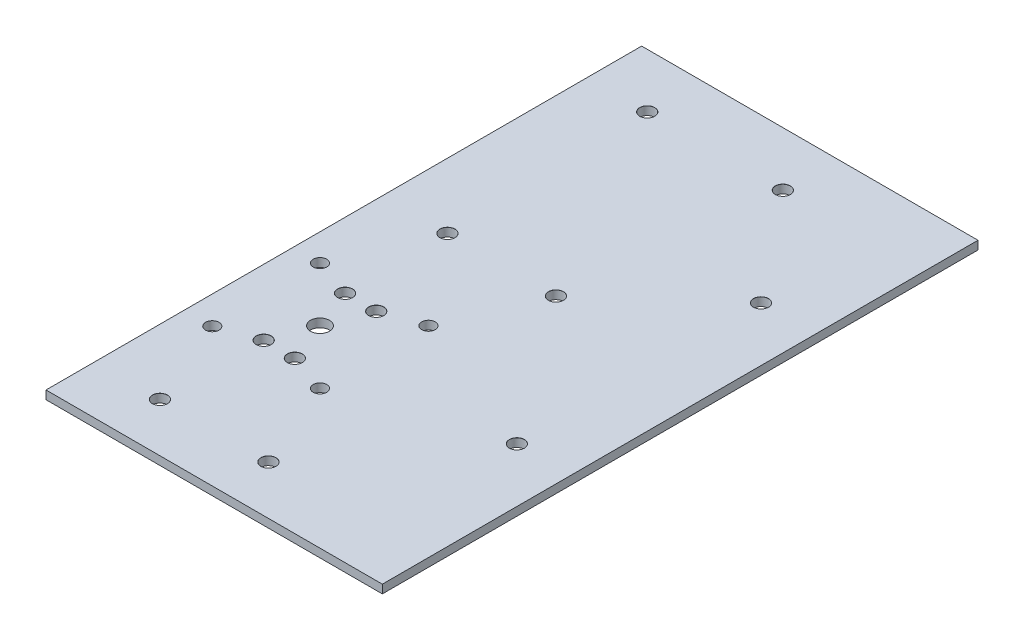
ISO-10303-21;
HEADER;
FILE_DESCRIPTION(('STEP AP214'),'2;1');
FILE_NAME('part.step','',(''),(''),'','','');
FILE_SCHEMA(('AUTOMOTIVE_DESIGN { 1 0 10303 214 1 1 1 1 }'));
ENDSEC;
DATA;
#1=APPLICATION_CONTEXT('core data for automotive mechanical design processes');
#2=APPLICATION_PROTOCOL_DEFINITION('international standard','automotive_design',2000,#1);
#3=PRODUCT_CONTEXT('',#1,'mechanical');
#4=PRODUCT('Part','Part','',(#3));
#5=PRODUCT_RELATED_PRODUCT_CATEGORY('part','',(#4));
#6=PRODUCT_DEFINITION_FORMATION('','',#4);
#7=PRODUCT_DEFINITION_CONTEXT('part definition',#1,'design');
#8=PRODUCT_DEFINITION('design','',#6,#7);
#9=PRODUCT_DEFINITION_SHAPE('','',#8);
#10=(LENGTH_UNIT() NAMED_UNIT(*) SI_UNIT(.MILLI.,.METRE.));
#11=(NAMED_UNIT(*) PLANE_ANGLE_UNIT() SI_UNIT($,.RADIAN.));
#12=(NAMED_UNIT(*) SI_UNIT($,.STERADIAN.) SOLID_ANGLE_UNIT());
#13=UNCERTAINTY_MEASURE_WITH_UNIT(LENGTH_MEASURE(1.E-05),#10,'distance_accuracy_value','');
#14=(GEOMETRIC_REPRESENTATION_CONTEXT(3) GLOBAL_UNCERTAINTY_ASSIGNED_CONTEXT((#13)) GLOBAL_UNIT_ASSIGNED_CONTEXT((#10,
#11,#12)) REPRESENTATION_CONTEXT('',''));
#15=CARTESIAN_POINT('',(0.,0.,0.));
#16=DIRECTION('',(0.,0.,1.));
#17=DIRECTION('',(1.,0.,0.));
#18=AXIS2_PLACEMENT_3D('',#15,#16,#17);
#19=CARTESIAN_POINT('',(0.,3.125,0.));
#20=DIRECTION('',(0.,-1.,0.));
#21=DIRECTION('',(0.,0.,-1.));
#22=AXIS2_PLACEMENT_3D('',#19,#20,#21);
#23=PLANE('',#22);
#24=CARTESIAN_POINT('',(24.,3.125,-124.));
#25=DIRECTION('',(0.,1.,0.));
#26=DIRECTION('',(0.,0.,1.));
#27=AXIS2_PLACEMENT_3D('',#24,#25,#26);
#28=CIRCLE('',#27,2.775);
#29=CARTESIAN_POINT('',(24.,3.125,-121.225));
#30=VERTEX_POINT('',#29);
#31=EDGE_CURVE('E560',#30,#30,#28,.T.);
#32=ORIENTED_EDGE('',*,*,#31,.F.);
#33=EDGE_LOOP('',(#32));
#34=FACE_BOUND('',#33,.T.);
#35=CARTESIAN_POINT('',(64.,3.125,-124.));
#36=DIRECTION('',(0.,1.,0.));
#37=DIRECTION('',(0.,0.,1.));
#38=AXIS2_PLACEMENT_3D('',#35,#36,#37);
#39=CIRCLE('',#38,2.775);
#40=CARTESIAN_POINT('',(64.,3.125,-121.225));
#41=VERTEX_POINT('',#40);
#42=EDGE_CURVE('E567',#41,#41,#39,.T.);
#43=ORIENTED_EDGE('',*,*,#42,.F.);
#44=EDGE_LOOP('',(#43));
#45=FACE_BOUND('',#44,.T.);
#46=CARTESIAN_POINT('',(24.,3.125,-18.));
#47=DIRECTION('',(0.,1.,0.));
#48=DIRECTION('',(0.,0.,1.));
#49=AXIS2_PLACEMENT_3D('',#46,#47,#48);
#50=CIRCLE('',#49,2.775);
#51=CARTESIAN_POINT('',(24.,3.125,-15.225));
#52=VERTEX_POINT('',#51);
#53=EDGE_CURVE('E576',#52,#52,#50,.T.);
#54=ORIENTED_EDGE('',*,*,#53,.F.);
#55=EDGE_LOOP('',(#54));
#56=FACE_BOUND('',#55,.T.);
#57=CARTESIAN_POINT('',(64.,3.125,-18.));
#58=DIRECTION('',(0.,1.,0.));
#59=DIRECTION('',(0.,0.,1.));
#60=AXIS2_PLACEMENT_3D('',#57,#58,#59);
#61=CIRCLE('',#60,2.775);
#62=CARTESIAN_POINT('',(64.,3.125,-15.225));
#63=VERTEX_POINT('',#62);
#64=EDGE_CURVE('E585',#63,#63,#61,.T.);
#65=ORIENTED_EDGE('',*,*,#64,.F.);
#66=EDGE_LOOP('',(#65));
#67=FACE_BOUND('',#66,.T.);
#68=CARTESIAN_POINT('',(22.0495894973803,3.125,-199.6));
#69=DIRECTION('',(0.,1.,0.));
#70=DIRECTION('',(0.,0.,1.));
#71=AXIS2_PLACEMENT_3D('',#68,#69,#70);
#72=CIRCLE('',#71,2.775);
#73=CARTESIAN_POINT('',(22.0495894973803,3.125,-196.825));
#74=VERTEX_POINT('',#73);
#75=EDGE_CURVE('E594',#74,#74,#72,.T.);
#76=ORIENTED_EDGE('',*,*,#75,.F.);
#77=EDGE_LOOP('',(#76));
#78=FACE_BOUND('',#77,.T.);
#79=CARTESIAN_POINT('',(72.0495894973803,3.125,-199.6));
#80=DIRECTION('',(0.,1.,0.));
#81=DIRECTION('',(0.,0.,1.));
#82=AXIS2_PLACEMENT_3D('',#79,#80,#81);
#83=CIRCLE('',#82,2.775);
#84=CARTESIAN_POINT('',(72.0495894973803,3.125,-196.825));
#85=VERTEX_POINT('',#84);
#86=EDGE_CURVE('E171',#85,#85,#83,.T.);
#87=ORIENTED_EDGE('',*,*,#86,.F.);
#88=EDGE_LOOP('',(#87));
#89=FACE_BOUND('',#88,.T.);
#90=CARTESIAN_POINT('',(104.,3.125,-159.6));
#91=DIRECTION('',(0.,1.,0.));
#92=DIRECTION('',(0.,0.,1.));
#93=AXIS2_PLACEMENT_3D('',#90,#91,#92);
#94=CIRCLE('',#93,2.775);
#95=CARTESIAN_POINT('',(104.,3.125,-156.825));
#96=VERTEX_POINT('',#95);
#97=EDGE_CURVE('E164',#96,#96,#94,.T.);
#98=ORIENTED_EDGE('',*,*,#97,.F.);
#99=EDGE_LOOP('',(#98));
#100=FACE_BOUND('',#99,.T.);
#101=CARTESIAN_POINT('',(104.,3.125,-69.6));
#102=DIRECTION('',(0.,1.,0.));
#103=DIRECTION('',(0.,0.,1.));
#104=AXIS2_PLACEMENT_3D('',#101,#102,#103);
#105=CIRCLE('',#104,2.775);
#106=CARTESIAN_POINT('',(104.,3.125,-66.825));
#107=VERTEX_POINT('',#106);
#108=EDGE_CURVE('E160',#107,#107,#105,.T.);
#109=ORIENTED_EDGE('',*,*,#108,.F.);
#110=EDGE_LOOP('',(#109));
#111=FACE_BOUND('',#110,.T.);
#112=CARTESIAN_POINT('',(24.25,3.125,-86.));
#113=DIRECTION('',(0.,1.,0.));
#114=DIRECTION('',(0.,0.,1.));
#115=AXIS2_PLACEMENT_3D('',#112,#113,#114);
#116=CIRCLE('',#115,2.775);
#117=CARTESIAN_POINT('',(24.25,3.125,-83.225));
#118=VERTEX_POINT('',#117);
#119=EDGE_CURVE('E156',#118,#118,#116,.T.);
#120=ORIENTED_EDGE('',*,*,#119,.F.);
#121=EDGE_LOOP('',(#120));
#122=FACE_BOUND('',#121,.T.);
#123=CARTESIAN_POINT('',(35.75,3.125,-86.));
#124=DIRECTION('',(0.,1.,0.));
#125=DIRECTION('',(0.,0.,1.));
#126=AXIS2_PLACEMENT_3D('',#123,#124,#125);
#127=CIRCLE('',#126,2.775);
#128=CARTESIAN_POINT('',(35.75,3.125,-83.225));
#129=VERTEX_POINT('',#128);
#130=EDGE_CURVE('E151',#129,#129,#127,.T.);
#131=ORIENTED_EDGE('',*,*,#130,.F.);
#132=EDGE_LOOP('',(#131));
#133=FACE_BOUND('',#132,.T.);
#134=CARTESIAN_POINT('',(35.75,3.125,-56.));
#135=DIRECTION('',(0.,1.,0.));
#136=DIRECTION('',(0.,0.,1.));
#137=AXIS2_PLACEMENT_3D('',#134,#135,#136);
#138=CIRCLE('',#137,2.775);
#139=CARTESIAN_POINT('',(35.75,3.125,-53.225));
#140=VERTEX_POINT('',#139);
#141=EDGE_CURVE('E146',#140,#140,#138,.T.);
#142=ORIENTED_EDGE('',*,*,#141,.F.);
#143=EDGE_LOOP('',(#142));
#144=FACE_BOUND('',#143,.T.);
#145=CARTESIAN_POINT('',(24.25,3.125,-56.));
#146=DIRECTION('',(0.,1.,0.));
#147=DIRECTION('',(0.,0.,1.));
#148=AXIS2_PLACEMENT_3D('',#145,#146,#147);
#149=CIRCLE('',#148,2.775);
#150=CARTESIAN_POINT('',(24.25,3.125,-53.225));
#151=VERTEX_POINT('',#150);
#152=EDGE_CURVE('E141',#151,#151,#149,.T.);
#153=ORIENTED_EDGE('',*,*,#152,.F.);
#154=EDGE_LOOP('',(#153));
#155=FACE_BOUND('',#154,.T.);
#156=CARTESIAN_POINT('',(9.99999999999999,3.125,-91.));
#157=DIRECTION('',(0.,1.,0.));
#158=DIRECTION('',(0.,0.,1.));
#159=AXIS2_PLACEMENT_3D('',#156,#157,#158);
#160=CIRCLE('',#159,2.5);
#161=CARTESIAN_POINT('',(9.99999999999999,3.125,-88.5));
#162=VERTEX_POINT('',#161);
#163=EDGE_CURVE('E136',#162,#162,#160,.T.);
#164=ORIENTED_EDGE('',*,*,#163,.F.);
#165=EDGE_LOOP('',(#164));
#166=FACE_BOUND('',#165,.T.);
#167=CARTESIAN_POINT('',(50.,3.125,-91.));
#168=DIRECTION('',(0.,1.,0.));
#169=DIRECTION('',(0.,0.,1.));
#170=AXIS2_PLACEMENT_3D('',#167,#168,#169);
#171=CIRCLE('',#170,2.5);
#172=CARTESIAN_POINT('',(50.,3.125,-88.5));
#173=VERTEX_POINT('',#172);
#174=EDGE_CURVE('E204',#173,#173,#171,.T.);
#175=ORIENTED_EDGE('',*,*,#174,.F.);
#176=EDGE_LOOP('',(#175));
#177=FACE_BOUND('',#176,.T.);
#178=CARTESIAN_POINT('',(50.,3.125,-51.));
#179=DIRECTION('',(0.,1.,0.));
#180=DIRECTION('',(0.,0.,1.));
#181=AXIS2_PLACEMENT_3D('',#178,#179,#180);
#182=CIRCLE('',#181,2.5);
#183=CARTESIAN_POINT('',(50.,3.125,-48.5));
#184=VERTEX_POINT('',#183);
#185=EDGE_CURVE('E201',#184,#184,#182,.T.);
#186=ORIENTED_EDGE('',*,*,#185,.F.);
#187=EDGE_LOOP('',(#186));
#188=FACE_BOUND('',#187,.T.);
#189=CARTESIAN_POINT('',(10.3126727569179,3.125,-51.));
#190=DIRECTION('',(0.,1.,0.));
#191=DIRECTION('',(0.,0.,1.));
#192=AXIS2_PLACEMENT_3D('',#189,#190,#191);
#193=CIRCLE('',#192,2.5);
#194=CARTESIAN_POINT('',(10.3126727569179,3.125,-48.5));
#195=VERTEX_POINT('',#194);
#196=EDGE_CURVE('E123',#195,#195,#193,.T.);
#197=ORIENTED_EDGE('',*,*,#196,.F.);
#198=EDGE_LOOP('',(#197));
#199=FACE_BOUND('',#198,.T.);
#200=DIRECTION('',(0.,0.,1.));
#201=VECTOR('',#200,1.);
#202=CARTESIAN_POINT('',(0.,3.125,0.));
#203=LINE('',#202,#201);
#204=CARTESIAN_POINT('',(0.,3.125,-219.6));
#205=VERTEX_POINT('',#204);
#206=CARTESIAN_POINT('',(0.,3.125,0.));
#207=VERTEX_POINT('',#206);
#208=EDGE_CURVE('E97',#205,#207,#203,.T.);
#209=ORIENTED_EDGE('',*,*,#208,.T.);
#210=DIRECTION('',(1.,0.,0.));
#211=VECTOR('',#210,1.);
#212=CARTESIAN_POINT('',(0.,3.125,0.));
#213=LINE('',#212,#211);
#214=CARTESIAN_POINT('',(124.,3.125,0.));
#215=VERTEX_POINT('',#214);
#216=EDGE_CURVE('E92',#207,#215,#213,.T.);
#217=ORIENTED_EDGE('',*,*,#216,.T.);
#218=DIRECTION('',(0.,0.,-1.));
#219=VECTOR('',#218,1.);
#220=CARTESIAN_POINT('',(124.,3.125,0.));
#221=LINE('',#220,#219);
#222=CARTESIAN_POINT('',(124.,3.125,-219.6));
#223=VERTEX_POINT('',#222);
#224=EDGE_CURVE('E95',#215,#223,#221,.T.);
#225=ORIENTED_EDGE('',*,*,#224,.T.);
#226=DIRECTION('',(-1.,0.,0.));
#227=VECTOR('',#226,1.);
#228=CARTESIAN_POINT('',(0.,3.125,-219.6));
#229=LINE('',#228,#227);
#230=EDGE_CURVE('E62',#223,#205,#229,.T.);
#231=ORIENTED_EDGE('',*,*,#230,.T.);
#232=EDGE_LOOP('',(#209,#217,#225,#231));
#233=FACE_BOUND('',#232,.T.);
#234=CARTESIAN_POINT('',(30.,3.125,-71.));
#235=DIRECTION('',(0.,1.,0.));
#236=DIRECTION('',(0.,0.,1.));
#237=AXIS2_PLACEMENT_3D('',#234,#235,#236);
#238=CIRCLE('',#237,3.5);
#239=CARTESIAN_POINT('',(30.,3.125,-67.5));
#240=VERTEX_POINT('',#239);
#241=EDGE_CURVE('E113',#240,#240,#238,.T.);
#242=ORIENTED_EDGE('',*,*,#241,.F.);
#243=EDGE_LOOP('',(#242));
#244=FACE_BOUND('',#243,.T.);
#245=ADVANCED_FACE('F43',(#34,#45,#56,#67,#78,#89,#100,#111,#122,#133,#144,#155,#166,#177,#188,
#199,#233,#244),#23,.F.);
#246=CARTESIAN_POINT('',(0.,0.,0.));
#247=DIRECTION('',(0.,-1.,0.));
#248=DIRECTION('',(0.,0.,-1.));
#249=AXIS2_PLACEMENT_3D('',#246,#247,#248);
#250=PLANE('',#249);
#251=CARTESIAN_POINT('',(24.,0.,-124.));
#252=DIRECTION('',(0.,1.,0.));
#253=DIRECTION('',(0.,0.,1.));
#254=AXIS2_PLACEMENT_3D('',#251,#252,#253);
#255=CIRCLE('',#254,2.75);
#256=CARTESIAN_POINT('',(24.,0.,-121.25));
#257=VERTEX_POINT('',#256);
#258=EDGE_CURVE('E562',#257,#257,#255,.T.);
#259=ORIENTED_EDGE('',*,*,#258,.T.);
#260=EDGE_LOOP('',(#259));
#261=FACE_BOUND('',#260,.T.);
#262=CARTESIAN_POINT('',(64.,0.,-124.));
#263=DIRECTION('',(0.,1.,0.));
#264=DIRECTION('',(0.,0.,1.));
#265=AXIS2_PLACEMENT_3D('',#262,#263,#264);
#266=CIRCLE('',#265,2.75);
#267=CARTESIAN_POINT('',(64.,0.,-121.25));
#268=VERTEX_POINT('',#267);
#269=EDGE_CURVE('E573',#268,#268,#266,.T.);
#270=ORIENTED_EDGE('',*,*,#269,.T.);
#271=EDGE_LOOP('',(#270));
#272=FACE_BOUND('',#271,.T.);
#273=CARTESIAN_POINT('',(24.,0.,-18.));
#274=DIRECTION('',(0.,1.,0.));
#275=DIRECTION('',(0.,0.,1.));
#276=AXIS2_PLACEMENT_3D('',#273,#274,#275);
#277=CIRCLE('',#276,2.75);
#278=CARTESIAN_POINT('',(24.,0.,-15.25));
#279=VERTEX_POINT('',#278);
#280=EDGE_CURVE('E582',#279,#279,#277,.T.);
#281=ORIENTED_EDGE('',*,*,#280,.T.);
#282=EDGE_LOOP('',(#281));
#283=FACE_BOUND('',#282,.T.);
#284=CARTESIAN_POINT('',(64.,0.,-18.));
#285=DIRECTION('',(0.,1.,0.));
#286=DIRECTION('',(0.,0.,1.));
#287=AXIS2_PLACEMENT_3D('',#284,#285,#286);
#288=CIRCLE('',#287,2.75);
#289=CARTESIAN_POINT('',(64.,0.,-15.25));
#290=VERTEX_POINT('',#289);
#291=EDGE_CURVE('E591',#290,#290,#288,.T.);
#292=ORIENTED_EDGE('',*,*,#291,.T.);
#293=EDGE_LOOP('',(#292));
#294=FACE_BOUND('',#293,.T.);
#295=CARTESIAN_POINT('',(22.0495894973803,0.,-199.6));
#296=DIRECTION('',(0.,-1.,0.));
#297=DIRECTION('',(0.,0.,-1.));
#298=AXIS2_PLACEMENT_3D('',#295,#296,#297);
#299=CIRCLE('',#298,2.74999999999999);
#300=CARTESIAN_POINT('',(22.0495894973803,0.,-202.35));
#301=VERTEX_POINT('',#300);
#302=EDGE_CURVE('E47',#301,#301,#299,.T.);
#303=ORIENTED_EDGE('',*,*,#302,.F.);
#304=EDGE_LOOP('',(#303));
#305=FACE_BOUND('',#304,.T.);
#306=CARTESIAN_POINT('',(72.0495894973803,0.,-199.6));
#307=DIRECTION('',(0.,-1.,0.));
#308=DIRECTION('',(0.,0.,-1.));
#309=AXIS2_PLACEMENT_3D('',#306,#307,#308);
#310=CIRCLE('',#309,2.74999999999999);
#311=CARTESIAN_POINT('',(72.0495894973803,0.,-202.35));
#312=VERTEX_POINT('',#311);
#313=EDGE_CURVE('E162',#312,#312,#310,.T.);
#314=ORIENTED_EDGE('',*,*,#313,.F.);
#315=EDGE_LOOP('',(#314));
#316=FACE_BOUND('',#315,.T.);
#317=CARTESIAN_POINT('',(104.,0.,-159.6));
#318=DIRECTION('',(0.,-1.,0.));
#319=DIRECTION('',(0.,0.,-1.));
#320=AXIS2_PLACEMENT_3D('',#317,#318,#319);
#321=CIRCLE('',#320,2.74999999999999);
#322=CARTESIAN_POINT('',(104.,0.,-162.35));
#323=VERTEX_POINT('',#322);
#324=EDGE_CURVE('E158',#323,#323,#321,.T.);
#325=ORIENTED_EDGE('',*,*,#324,.F.);
#326=EDGE_LOOP('',(#325));
#327=FACE_BOUND('',#326,.T.);
#328=CARTESIAN_POINT('',(104.,0.,-69.6));
#329=DIRECTION('',(0.,-1.,0.));
#330=DIRECTION('',(0.,0.,-1.));
#331=AXIS2_PLACEMENT_3D('',#328,#329,#330);
#332=CIRCLE('',#331,2.74999999999999);
#333=CARTESIAN_POINT('',(104.,0.,-72.35));
#334=VERTEX_POINT('',#333);
#335=EDGE_CURVE('E153',#334,#334,#332,.T.);
#336=ORIENTED_EDGE('',*,*,#335,.F.);
#337=EDGE_LOOP('',(#336));
#338=FACE_BOUND('',#337,.T.);
#339=CARTESIAN_POINT('',(24.25,0.,-86.));
#340=DIRECTION('',(0.,-1.,0.));
#341=DIRECTION('',(0.,0.,-1.));
#342=AXIS2_PLACEMENT_3D('',#339,#340,#341);
#343=CIRCLE('',#342,2.74999999999999);
#344=CARTESIAN_POINT('',(24.25,0.,-88.75));
#345=VERTEX_POINT('',#344);
#346=EDGE_CURVE('E148',#345,#345,#343,.T.);
#347=ORIENTED_EDGE('',*,*,#346,.F.);
#348=EDGE_LOOP('',(#347));
#349=FACE_BOUND('',#348,.T.);
#350=CARTESIAN_POINT('',(35.75,0.,-86.));
#351=DIRECTION('',(0.,-1.,0.));
#352=DIRECTION('',(0.,0.,-1.));
#353=AXIS2_PLACEMENT_3D('',#350,#351,#352);
#354=CIRCLE('',#353,2.74999999999999);
#355=CARTESIAN_POINT('',(35.75,0.,-88.75));
#356=VERTEX_POINT('',#355);
#357=EDGE_CURVE('E143',#356,#356,#354,.T.);
#358=ORIENTED_EDGE('',*,*,#357,.F.);
#359=EDGE_LOOP('',(#358));
#360=FACE_BOUND('',#359,.T.);
#361=CARTESIAN_POINT('',(35.75,0.,-56.));
#362=DIRECTION('',(0.,-1.,0.));
#363=DIRECTION('',(0.,0.,-1.));
#364=AXIS2_PLACEMENT_3D('',#361,#362,#363);
#365=CIRCLE('',#364,2.74999999999999);
#366=CARTESIAN_POINT('',(35.75,0.,-58.75));
#367=VERTEX_POINT('',#366);
#368=EDGE_CURVE('E138',#367,#367,#365,.T.);
#369=ORIENTED_EDGE('',*,*,#368,.F.);
#370=EDGE_LOOP('',(#369));
#371=FACE_BOUND('',#370,.T.);
#372=CARTESIAN_POINT('',(24.25,0.,-56.));
#373=DIRECTION('',(0.,-1.,0.));
#374=DIRECTION('',(0.,0.,-1.));
#375=AXIS2_PLACEMENT_3D('',#372,#373,#374);
#376=CIRCLE('',#375,2.74999999999999);
#377=CARTESIAN_POINT('',(24.25,0.,-58.75));
#378=VERTEX_POINT('',#377);
#379=EDGE_CURVE('E133',#378,#378,#376,.T.);
#380=ORIENTED_EDGE('',*,*,#379,.F.);
#381=EDGE_LOOP('',(#380));
#382=FACE_BOUND('',#381,.T.);
#383=CARTESIAN_POINT('',(9.99999999999999,0.,-91.));
#384=DIRECTION('',(0.,-1.,0.));
#385=DIRECTION('',(0.,0.,-1.));
#386=AXIS2_PLACEMENT_3D('',#383,#384,#385);
#387=CIRCLE('',#386,2.5);
#388=CARTESIAN_POINT('',(9.99999999999999,0.,-93.5));
#389=VERTEX_POINT('',#388);
#390=EDGE_CURVE('E129',#389,#389,#387,.T.);
#391=ORIENTED_EDGE('',*,*,#390,.F.);
#392=EDGE_LOOP('',(#391));
#393=FACE_BOUND('',#392,.T.);
#394=CARTESIAN_POINT('',(50.,0.,-91.));
#395=DIRECTION('',(0.,-1.,0.));
#396=DIRECTION('',(0.,0.,-1.));
#397=AXIS2_PLACEMENT_3D('',#394,#395,#396);
#398=CIRCLE('',#397,2.5);
#399=CARTESIAN_POINT('',(50.,0.,-93.5));
#400=VERTEX_POINT('',#399);
#401=EDGE_CURVE('E126',#400,#400,#398,.T.);
#402=ORIENTED_EDGE('',*,*,#401,.F.);
#403=EDGE_LOOP('',(#402));
#404=FACE_BOUND('',#403,.T.);
#405=CARTESIAN_POINT('',(50.,0.,-51.));
#406=DIRECTION('',(0.,-1.,0.));
#407=DIRECTION('',(0.,0.,-1.));
#408=AXIS2_PLACEMENT_3D('',#405,#406,#407);
#409=CIRCLE('',#408,2.5);
#410=CARTESIAN_POINT('',(50.,0.,-53.5));
#411=VERTEX_POINT('',#410);
#412=EDGE_CURVE('E122',#411,#411,#409,.T.);
#413=ORIENTED_EDGE('',*,*,#412,.F.);
#414=EDGE_LOOP('',(#413));
#415=FACE_BOUND('',#414,.T.);
#416=CARTESIAN_POINT('',(10.3126727569179,0.,-51.));
#417=DIRECTION('',(0.,-1.,0.));
#418=DIRECTION('',(0.,0.,-1.));
#419=AXIS2_PLACEMENT_3D('',#416,#417,#418);
#420=CIRCLE('',#419,2.5);
#421=CARTESIAN_POINT('',(10.3126727569179,0.,-53.5));
#422=VERTEX_POINT('',#421);
#423=EDGE_CURVE('E119',#422,#422,#420,.T.);
#424=ORIENTED_EDGE('',*,*,#423,.F.);
#425=EDGE_LOOP('',(#424));
#426=FACE_BOUND('',#425,.T.);
#427=DIRECTION('',(0.,0.,1.));
#428=VECTOR('',#427,1.);
#429=CARTESIAN_POINT('',(0.,0.,0.));
#430=LINE('',#429,#428);
#431=CARTESIAN_POINT('',(0.,0.,-219.6));
#432=VERTEX_POINT('',#431);
#433=CARTESIAN_POINT('',(0.,0.,0.));
#434=VERTEX_POINT('',#433);
#435=EDGE_CURVE('E110',#432,#434,#430,.T.);
#436=ORIENTED_EDGE('',*,*,#435,.F.);
#437=DIRECTION('',(-1.,0.,0.));
#438=VECTOR('',#437,1.);
#439=CARTESIAN_POINT('',(0.,0.,-219.6));
#440=LINE('',#439,#438);
#441=CARTESIAN_POINT('',(124.,0.,-219.6));
#442=VERTEX_POINT('',#441);
#443=EDGE_CURVE('E85',#442,#432,#440,.T.);
#444=ORIENTED_EDGE('',*,*,#443,.F.);
#445=DIRECTION('',(0.,0.,-1.));
#446=VECTOR('',#445,1.);
#447=CARTESIAN_POINT('',(124.,0.,0.));
#448=LINE('',#447,#446);
#449=CARTESIAN_POINT('',(124.,0.,0.));
#450=VERTEX_POINT('',#449);
#451=EDGE_CURVE('E79',#450,#442,#448,.T.);
#452=ORIENTED_EDGE('',*,*,#451,.F.);
#453=DIRECTION('',(1.,0.,0.));
#454=VECTOR('',#453,1.);
#455=CARTESIAN_POINT('',(0.,0.,0.));
#456=LINE('',#455,#454);
#457=EDGE_CURVE('E101',#434,#450,#456,.T.);
#458=ORIENTED_EDGE('',*,*,#457,.F.);
#459=EDGE_LOOP('',(#436,#444,#452,#458));
#460=FACE_BOUND('',#459,.T.);
#461=CARTESIAN_POINT('',(30.,0.,-71.));
#462=DIRECTION('',(0.,1.,0.));
#463=DIRECTION('',(0.,0.,1.));
#464=AXIS2_PLACEMENT_3D('',#461,#462,#463);
#465=CIRCLE('',#464,3.5);
#466=CARTESIAN_POINT('',(30.,0.,-67.5));
#467=VERTEX_POINT('',#466);
#468=EDGE_CURVE('E132',#467,#467,#465,.T.);
#469=ORIENTED_EDGE('',*,*,#468,.T.);
#470=EDGE_LOOP('',(#469));
#471=FACE_BOUND('',#470,.T.);
#472=ADVANCED_FACE('F216',(#261,#272,#283,#294,#305,#316,#327,#338,#349,#360,#371,#382,#393,
#404,#415,#426,#460,#471),#250,.T.);
#473=CARTESIAN_POINT('',(0.,3.125,0.));
#474=DIRECTION('',(1.,0.,0.));
#475=DIRECTION('',(0.,0.,-1.));
#476=AXIS2_PLACEMENT_3D('',#473,#474,#475);
#477=PLANE('',#476);
#478=ORIENTED_EDGE('',*,*,#435,.T.);
#479=DIRECTION('',(0.,-1.,0.));
#480=VECTOR('',#479,1.);
#481=CARTESIAN_POINT('',(0.,3.125,0.));
#482=LINE('',#481,#480);
#483=EDGE_CURVE('E11',#207,#434,#482,.T.);
#484=ORIENTED_EDGE('',*,*,#483,.F.);
#485=ORIENTED_EDGE('',*,*,#208,.F.);
#486=DIRECTION('',(0.,-1.,0.));
#487=VECTOR('',#486,1.);
#488=CARTESIAN_POINT('',(0.,3.125,-219.6));
#489=LINE('',#488,#487);
#490=EDGE_CURVE('E106',#205,#432,#489,.T.);
#491=ORIENTED_EDGE('',*,*,#490,.T.);
#492=EDGE_LOOP('',(#478,#484,#485,#491));
#493=FACE_BOUND('',#492,.T.);
#494=ADVANCED_FACE('F45',(#493),#477,.F.);
#495=CARTESIAN_POINT('',(0.,3.125,0.));
#496=DIRECTION('',(0.,0.,-1.));
#497=DIRECTION('',(-1.,0.,0.));
#498=AXIS2_PLACEMENT_3D('',#495,#496,#497);
#499=PLANE('',#498);
#500=ORIENTED_EDGE('',*,*,#457,.T.);
#501=DIRECTION('',(0.,-1.,0.));
#502=VECTOR('',#501,1.);
#503=CARTESIAN_POINT('',(124.,3.125,0.));
#504=LINE('',#503,#502);
#505=EDGE_CURVE('E53',#215,#450,#504,.T.);
#506=ORIENTED_EDGE('',*,*,#505,.F.);
#507=ORIENTED_EDGE('',*,*,#216,.F.);
#508=ORIENTED_EDGE('',*,*,#483,.T.);
#509=EDGE_LOOP('',(#500,#506,#507,#508));
#510=FACE_BOUND('',#509,.T.);
#511=ADVANCED_FACE('F100',(#510),#499,.F.);
#512=CARTESIAN_POINT('',(124.,3.125,0.));
#513=DIRECTION('',(-1.,0.,0.));
#514=DIRECTION('',(0.,0.,1.));
#515=AXIS2_PLACEMENT_3D('',#512,#513,#514);
#516=PLANE('',#515);
#517=ORIENTED_EDGE('',*,*,#451,.T.);
#518=DIRECTION('',(0.,-1.,0.));
#519=VECTOR('',#518,1.);
#520=CARTESIAN_POINT('',(124.,3.125,-219.6));
#521=LINE('',#520,#519);
#522=EDGE_CURVE('E102',#223,#442,#521,.T.);
#523=ORIENTED_EDGE('',*,*,#522,.F.);
#524=ORIENTED_EDGE('',*,*,#224,.F.);
#525=ORIENTED_EDGE('',*,*,#505,.T.);
#526=EDGE_LOOP('',(#517,#523,#524,#525));
#527=FACE_BOUND('',#526,.T.);
#528=ADVANCED_FACE('F104',(#527),#516,.F.);
#529=CARTESIAN_POINT('',(0.,3.125,-219.6));
#530=DIRECTION('',(0.,0.,1.));
#531=DIRECTION('',(1.,0.,0.));
#532=AXIS2_PLACEMENT_3D('',#529,#530,#531);
#533=PLANE('',#532);
#534=ORIENTED_EDGE('',*,*,#443,.T.);
#535=ORIENTED_EDGE('',*,*,#490,.F.);
#536=ORIENTED_EDGE('',*,*,#230,.F.);
#537=ORIENTED_EDGE('',*,*,#522,.T.);
#538=EDGE_LOOP('',(#534,#535,#536,#537));
#539=FACE_BOUND('',#538,.T.);
#540=ADVANCED_FACE('F221',(#539),#533,.F.);
#541=CARTESIAN_POINT('',(30.,3.125,-71.));
#542=DIRECTION('',(0.,-1.,0.));
#543=DIRECTION('',(0.,0.,-1.));
#544=AXIS2_PLACEMENT_3D('',#541,#542,#543);
#545=CYLINDRICAL_SURFACE('',#544,3.5);
#546=ORIENTED_EDGE('',*,*,#241,.T.);
#547=EDGE_LOOP('',(#546));
#548=FACE_BOUND('',#547,.T.);
#549=ORIENTED_EDGE('',*,*,#468,.F.);
#550=EDGE_LOOP('',(#549));
#551=FACE_BOUND('',#550,.T.);
#552=ADVANCED_FACE('F218',(#548,#551),#545,.F.);
#553=CARTESIAN_POINT('',(10.3126727569179,-6.875,-51.));
#554=DIRECTION('',(0.,1.,0.));
#555=DIRECTION('',(0.,0.,1.));
#556=AXIS2_PLACEMENT_3D('',#553,#554,#555);
#557=CYLINDRICAL_SURFACE('',#556,2.5);
#558=ORIENTED_EDGE('',*,*,#423,.T.);
#559=EDGE_LOOP('',(#558));
#560=FACE_BOUND('',#559,.T.);
#561=ORIENTED_EDGE('',*,*,#196,.T.);
#562=EDGE_LOOP('',(#561));
#563=FACE_BOUND('',#562,.T.);
#564=ADVANCED_FACE('F220',(#560,#563),#557,.F.);
#565=CARTESIAN_POINT('',(50.,-6.875,-51.));
#566=DIRECTION('',(0.,1.,0.));
#567=DIRECTION('',(0.,0.,1.));
#568=AXIS2_PLACEMENT_3D('',#565,#566,#567);
#569=CYLINDRICAL_SURFACE('',#568,2.5);
#570=ORIENTED_EDGE('',*,*,#412,.T.);
#571=EDGE_LOOP('',(#570));
#572=FACE_BOUND('',#571,.T.);
#573=ORIENTED_EDGE('',*,*,#185,.T.);
#574=EDGE_LOOP('',(#573));
#575=FACE_BOUND('',#574,.T.);
#576=ADVANCED_FACE('F228',(#572,#575),#569,.F.);
#577=CARTESIAN_POINT('',(50.,-6.875,-91.));
#578=DIRECTION('',(0.,1.,0.));
#579=DIRECTION('',(0.,0.,1.));
#580=AXIS2_PLACEMENT_3D('',#577,#578,#579);
#581=CYLINDRICAL_SURFACE('',#580,2.5);
#582=ORIENTED_EDGE('',*,*,#401,.T.);
#583=EDGE_LOOP('',(#582));
#584=FACE_BOUND('',#583,.T.);
#585=ORIENTED_EDGE('',*,*,#174,.T.);
#586=EDGE_LOOP('',(#585));
#587=FACE_BOUND('',#586,.T.);
#588=ADVANCED_FACE('F294',(#584,#587),#581,.F.);
#589=CARTESIAN_POINT('',(9.99999999999999,-6.875,-91.));
#590=DIRECTION('',(0.,1.,0.));
#591=DIRECTION('',(0.,0.,1.));
#592=AXIS2_PLACEMENT_3D('',#589,#590,#591);
#593=CYLINDRICAL_SURFACE('',#592,2.5);
#594=ORIENTED_EDGE('',*,*,#390,.T.);
#595=EDGE_LOOP('',(#594));
#596=FACE_BOUND('',#595,.T.);
#597=ORIENTED_EDGE('',*,*,#163,.T.);
#598=EDGE_LOOP('',(#597));
#599=FACE_BOUND('',#598,.T.);
#600=ADVANCED_FACE('F304',(#596,#599),#593,.F.);
#601=CARTESIAN_POINT('',(24.25,3.125,-56.));
#602=DIRECTION('',(0.,1.,0.));
#603=DIRECTION('',(0.,0.,1.));
#604=AXIS2_PLACEMENT_3D('',#601,#602,#603);
#605=CYLINDRICAL_SURFACE('',#604,2.74999999999999);
#606=ORIENTED_EDGE('',*,*,#379,.T.);
#607=EDGE_LOOP('',(#606));
#608=FACE_BOUND('',#607,.T.);
#609=CARTESIAN_POINT('',(24.25,3.09999999999999,-56.));
#610=DIRECTION('',(0.,1.,0.));
#611=DIRECTION('',(0.,0.,1.));
#612=AXIS2_PLACEMENT_3D('',#609,#610,#611);
#613=CIRCLE('',#612,2.74999999999999);
#614=CARTESIAN_POINT('',(24.25,3.09999999999999,-53.25));
#615=VERTEX_POINT('',#614);
#616=EDGE_CURVE('E137',#615,#615,#613,.T.);
#617=ORIENTED_EDGE('',*,*,#616,.T.);
#618=EDGE_LOOP('',(#617));
#619=FACE_BOUND('',#618,.T.);
#620=ADVANCED_FACE('F314',(#608,#619),#605,.F.);
#621=CARTESIAN_POINT('',(24.25,3.125,-56.));
#622=DIRECTION('',(0.,1.,0.));
#623=DIRECTION('',(0.,0.,1.));
#624=AXIS2_PLACEMENT_3D('',#621,#622,#623);
#625=CONICAL_SURFACE('',#624,2.775,0.785398163397414);
#626=ORIENTED_EDGE('',*,*,#616,.F.);
#627=EDGE_LOOP('',(#626));
#628=FACE_BOUND('',#627,.T.);
#629=ORIENTED_EDGE('',*,*,#152,.T.);
#630=EDGE_LOOP('',(#629));
#631=FACE_BOUND('',#630,.T.);
#632=ADVANCED_FACE('F324',(#628,#631),#625,.F.);
#633=CARTESIAN_POINT('',(35.75,3.125,-56.));
#634=DIRECTION('',(0.,1.,0.));
#635=DIRECTION('',(0.,0.,1.));
#636=AXIS2_PLACEMENT_3D('',#633,#634,#635);
#637=CYLINDRICAL_SURFACE('',#636,2.74999999999999);
#638=ORIENTED_EDGE('',*,*,#368,.T.);
#639=EDGE_LOOP('',(#638));
#640=FACE_BOUND('',#639,.T.);
#641=CARTESIAN_POINT('',(35.75,3.09999999999999,-56.));
#642=DIRECTION('',(0.,1.,0.));
#643=DIRECTION('',(0.,0.,1.));
#644=AXIS2_PLACEMENT_3D('',#641,#642,#643);
#645=CIRCLE('',#644,2.74999999999999);
#646=CARTESIAN_POINT('',(35.75,3.09999999999999,-53.25));
#647=VERTEX_POINT('',#646);
#648=EDGE_CURVE('E142',#647,#647,#645,.T.);
#649=ORIENTED_EDGE('',*,*,#648,.T.);
#650=EDGE_LOOP('',(#649));
#651=FACE_BOUND('',#650,.T.);
#652=ADVANCED_FACE('F334',(#640,#651),#637,.F.);
#653=CARTESIAN_POINT('',(35.75,3.125,-56.));
#654=DIRECTION('',(0.,1.,0.));
#655=DIRECTION('',(0.,0.,1.));
#656=AXIS2_PLACEMENT_3D('',#653,#654,#655);
#657=CONICAL_SURFACE('',#656,2.775,0.785398163397414);
#658=ORIENTED_EDGE('',*,*,#648,.F.);
#659=EDGE_LOOP('',(#658));
#660=FACE_BOUND('',#659,.T.);
#661=ORIENTED_EDGE('',*,*,#141,.T.);
#662=EDGE_LOOP('',(#661));
#663=FACE_BOUND('',#662,.T.);
#664=ADVANCED_FACE('F344',(#660,#663),#657,.F.);
#665=CARTESIAN_POINT('',(35.75,3.125,-86.));
#666=DIRECTION('',(0.,1.,0.));
#667=DIRECTION('',(0.,0.,1.));
#668=AXIS2_PLACEMENT_3D('',#665,#666,#667);
#669=CYLINDRICAL_SURFACE('',#668,2.74999999999999);
#670=ORIENTED_EDGE('',*,*,#357,.T.);
#671=EDGE_LOOP('',(#670));
#672=FACE_BOUND('',#671,.T.);
#673=CARTESIAN_POINT('',(35.75,3.09999999999999,-86.));
#674=DIRECTION('',(0.,1.,0.));
#675=DIRECTION('',(0.,0.,1.));
#676=AXIS2_PLACEMENT_3D('',#673,#674,#675);
#677=CIRCLE('',#676,2.74999999999999);
#678=CARTESIAN_POINT('',(35.75,3.09999999999999,-83.25));
#679=VERTEX_POINT('',#678);
#680=EDGE_CURVE('E147',#679,#679,#677,.T.);
#681=ORIENTED_EDGE('',*,*,#680,.T.);
#682=EDGE_LOOP('',(#681));
#683=FACE_BOUND('',#682,.T.);
#684=ADVANCED_FACE('F354',(#672,#683),#669,.F.);
#685=CARTESIAN_POINT('',(35.75,3.125,-86.));
#686=DIRECTION('',(0.,1.,0.));
#687=DIRECTION('',(0.,0.,1.));
#688=AXIS2_PLACEMENT_3D('',#685,#686,#687);
#689=CONICAL_SURFACE('',#688,2.775,0.785398163397414);
#690=ORIENTED_EDGE('',*,*,#680,.F.);
#691=EDGE_LOOP('',(#690));
#692=FACE_BOUND('',#691,.T.);
#693=ORIENTED_EDGE('',*,*,#130,.T.);
#694=EDGE_LOOP('',(#693));
#695=FACE_BOUND('',#694,.T.);
#696=ADVANCED_FACE('F364',(#692,#695),#689,.F.);
#697=CARTESIAN_POINT('',(24.25,3.125,-86.));
#698=DIRECTION('',(0.,1.,0.));
#699=DIRECTION('',(0.,0.,1.));
#700=AXIS2_PLACEMENT_3D('',#697,#698,#699);
#701=CYLINDRICAL_SURFACE('',#700,2.74999999999999);
#702=ORIENTED_EDGE('',*,*,#346,.T.);
#703=EDGE_LOOP('',(#702));
#704=FACE_BOUND('',#703,.T.);
#705=CARTESIAN_POINT('',(24.25,3.09999999999999,-86.));
#706=DIRECTION('',(0.,1.,0.));
#707=DIRECTION('',(0.,0.,1.));
#708=AXIS2_PLACEMENT_3D('',#705,#706,#707);
#709=CIRCLE('',#708,2.74999999999999);
#710=CARTESIAN_POINT('',(24.25,3.09999999999999,-83.25));
#711=VERTEX_POINT('',#710);
#712=EDGE_CURVE('E152',#711,#711,#709,.T.);
#713=ORIENTED_EDGE('',*,*,#712,.T.);
#714=EDGE_LOOP('',(#713));
#715=FACE_BOUND('',#714,.T.);
#716=ADVANCED_FACE('F374',(#704,#715),#701,.F.);
#717=CARTESIAN_POINT('',(24.25,3.125,-86.));
#718=DIRECTION('',(0.,1.,0.));
#719=DIRECTION('',(0.,0.,1.));
#720=AXIS2_PLACEMENT_3D('',#717,#718,#719);
#721=CONICAL_SURFACE('',#720,2.775,0.785398163397414);
#722=ORIENTED_EDGE('',*,*,#712,.F.);
#723=EDGE_LOOP('',(#722));
#724=FACE_BOUND('',#723,.T.);
#725=ORIENTED_EDGE('',*,*,#119,.T.);
#726=EDGE_LOOP('',(#725));
#727=FACE_BOUND('',#726,.T.);
#728=ADVANCED_FACE('F384',(#724,#727),#721,.F.);
#729=CARTESIAN_POINT('',(104.,3.125,-69.6));
#730=DIRECTION('',(0.,1.,0.));
#731=DIRECTION('',(0.,0.,1.));
#732=AXIS2_PLACEMENT_3D('',#729,#730,#731);
#733=CYLINDRICAL_SURFACE('',#732,2.74999999999999);
#734=ORIENTED_EDGE('',*,*,#335,.T.);
#735=EDGE_LOOP('',(#734));
#736=FACE_BOUND('',#735,.T.);
#737=CARTESIAN_POINT('',(104.,3.09999999999999,-69.6));
#738=DIRECTION('',(0.,1.,0.));
#739=DIRECTION('',(0.,0.,1.));
#740=AXIS2_PLACEMENT_3D('',#737,#738,#739);
#741=CIRCLE('',#740,2.74999999999999);
#742=CARTESIAN_POINT('',(104.,3.09999999999999,-66.85));
#743=VERTEX_POINT('',#742);
#744=EDGE_CURVE('E157',#743,#743,#741,.T.);
#745=ORIENTED_EDGE('',*,*,#744,.T.);
#746=EDGE_LOOP('',(#745));
#747=FACE_BOUND('',#746,.T.);
#748=ADVANCED_FACE('F394',(#736,#747),#733,.F.);
#749=CARTESIAN_POINT('',(104.,3.125,-69.6));
#750=DIRECTION('',(0.,1.,0.));
#751=DIRECTION('',(0.,0.,1.));
#752=AXIS2_PLACEMENT_3D('',#749,#750,#751);
#753=CONICAL_SURFACE('',#752,2.775,0.785398163397414);
#754=ORIENTED_EDGE('',*,*,#744,.F.);
#755=EDGE_LOOP('',(#754));
#756=FACE_BOUND('',#755,.T.);
#757=ORIENTED_EDGE('',*,*,#108,.T.);
#758=EDGE_LOOP('',(#757));
#759=FACE_BOUND('',#758,.T.);
#760=ADVANCED_FACE('F404',(#756,#759),#753,.F.);
#761=CARTESIAN_POINT('',(104.,3.125,-159.6));
#762=DIRECTION('',(0.,1.,0.));
#763=DIRECTION('',(0.,0.,1.));
#764=AXIS2_PLACEMENT_3D('',#761,#762,#763);
#765=CYLINDRICAL_SURFACE('',#764,2.74999999999999);
#766=ORIENTED_EDGE('',*,*,#324,.T.);
#767=EDGE_LOOP('',(#766));
#768=FACE_BOUND('',#767,.T.);
#769=CARTESIAN_POINT('',(104.,3.09999999999999,-159.6));
#770=DIRECTION('',(0.,1.,0.));
#771=DIRECTION('',(0.,0.,1.));
#772=AXIS2_PLACEMENT_3D('',#769,#770,#771);
#773=CIRCLE('',#772,2.74999999999999);
#774=CARTESIAN_POINT('',(104.,3.09999999999999,-156.85));
#775=VERTEX_POINT('',#774);
#776=EDGE_CURVE('E161',#775,#775,#773,.T.);
#777=ORIENTED_EDGE('',*,*,#776,.T.);
#778=EDGE_LOOP('',(#777));
#779=FACE_BOUND('',#778,.T.);
#780=ADVANCED_FACE('F414',(#768,#779),#765,.F.);
#781=CARTESIAN_POINT('',(104.,3.125,-159.6));
#782=DIRECTION('',(0.,1.,0.));
#783=DIRECTION('',(0.,0.,1.));
#784=AXIS2_PLACEMENT_3D('',#781,#782,#783);
#785=CONICAL_SURFACE('',#784,2.775,0.785398163397414);
#786=ORIENTED_EDGE('',*,*,#776,.F.);
#787=EDGE_LOOP('',(#786));
#788=FACE_BOUND('',#787,.T.);
#789=ORIENTED_EDGE('',*,*,#97,.T.);
#790=EDGE_LOOP('',(#789));
#791=FACE_BOUND('',#790,.T.);
#792=ADVANCED_FACE('F424',(#788,#791),#785,.F.);
#793=CARTESIAN_POINT('',(72.0495894973803,3.125,-199.6));
#794=DIRECTION('',(0.,1.,0.));
#795=DIRECTION('',(0.,0.,1.));
#796=AXIS2_PLACEMENT_3D('',#793,#794,#795);
#797=CYLINDRICAL_SURFACE('',#796,2.74999999999999);
#798=ORIENTED_EDGE('',*,*,#313,.T.);
#799=EDGE_LOOP('',(#798));
#800=FACE_BOUND('',#799,.T.);
#801=CARTESIAN_POINT('',(72.0495894973803,3.09999999999999,-199.6));
#802=DIRECTION('',(0.,1.,0.));
#803=DIRECTION('',(0.,0.,1.));
#804=AXIS2_PLACEMENT_3D('',#801,#802,#803);
#805=CIRCLE('',#804,2.74999999999999);
#806=CARTESIAN_POINT('',(72.0495894973803,3.09999999999999,-196.85));
#807=VERTEX_POINT('',#806);
#808=EDGE_CURVE('E165',#807,#807,#805,.T.);
#809=ORIENTED_EDGE('',*,*,#808,.T.);
#810=EDGE_LOOP('',(#809));
#811=FACE_BOUND('',#810,.T.);
#812=ADVANCED_FACE('F434',(#800,#811),#797,.F.);
#813=CARTESIAN_POINT('',(72.0495894973803,3.125,-199.6));
#814=DIRECTION('',(0.,1.,0.));
#815=DIRECTION('',(0.,0.,1.));
#816=AXIS2_PLACEMENT_3D('',#813,#814,#815);
#817=CONICAL_SURFACE('',#816,2.775,0.785398163397414);
#818=ORIENTED_EDGE('',*,*,#808,.F.);
#819=EDGE_LOOP('',(#818));
#820=FACE_BOUND('',#819,.T.);
#821=ORIENTED_EDGE('',*,*,#86,.T.);
#822=EDGE_LOOP('',(#821));
#823=FACE_BOUND('',#822,.T.);
#824=ADVANCED_FACE('F444',(#820,#823),#817,.F.);
#825=CARTESIAN_POINT('',(22.0495894973803,3.125,-199.6));
#826=DIRECTION('',(0.,1.,0.));
#827=DIRECTION('',(0.,0.,1.));
#828=AXIS2_PLACEMENT_3D('',#825,#826,#827);
#829=CYLINDRICAL_SURFACE('',#828,2.74999999999999);
#830=ORIENTED_EDGE('',*,*,#302,.T.);
#831=EDGE_LOOP('',(#830));
#832=FACE_BOUND('',#831,.T.);
#833=CARTESIAN_POINT('',(22.0495894973803,3.09999999999999,-199.6));
#834=DIRECTION('',(0.,1.,0.));
#835=DIRECTION('',(0.,0.,1.));
#836=AXIS2_PLACEMENT_3D('',#833,#834,#835);
#837=CIRCLE('',#836,2.74999999999999);
#838=CARTESIAN_POINT('',(22.0495894973803,3.09999999999999,-196.85));
#839=VERTEX_POINT('',#838);
#840=EDGE_CURVE('E596',#839,#839,#837,.T.);
#841=ORIENTED_EDGE('',*,*,#840,.T.);
#842=EDGE_LOOP('',(#841));
#843=FACE_BOUND('',#842,.T.);
#844=ADVANCED_FACE('F453',(#832,#843),#829,.F.);
#845=CARTESIAN_POINT('',(22.0495894973803,3.125,-199.6));
#846=DIRECTION('',(0.,1.,0.));
#847=DIRECTION('',(0.,0.,1.));
#848=AXIS2_PLACEMENT_3D('',#845,#846,#847);
#849=CONICAL_SURFACE('',#848,2.775,0.785398163397414);
#850=ORIENTED_EDGE('',*,*,#840,.F.);
#851=EDGE_LOOP('',(#850));
#852=FACE_BOUND('',#851,.T.);
#853=ORIENTED_EDGE('',*,*,#75,.T.);
#854=EDGE_LOOP('',(#853));
#855=FACE_BOUND('',#854,.T.);
#856=ADVANCED_FACE('F463',(#852,#855),#849,.F.);
#857=CARTESIAN_POINT('',(64.,3.125,-18.));
#858=DIRECTION('',(0.,1.,0.));
#859=DIRECTION('',(0.,0.,1.));
#860=AXIS2_PLACEMENT_3D('',#857,#858,#859);
#861=CYLINDRICAL_SURFACE('',#860,2.75);
#862=ORIENTED_EDGE('',*,*,#291,.F.);
#863=EDGE_LOOP('',(#862));
#864=FACE_BOUND('',#863,.T.);
#865=CARTESIAN_POINT('',(64.,3.1,-18.));
#866=DIRECTION('',(0.,1.,0.));
#867=DIRECTION('',(0.,0.,1.));
#868=AXIS2_PLACEMENT_3D('',#865,#866,#867);
#869=CIRCLE('',#868,2.75);
#870=CARTESIAN_POINT('',(64.,3.1,-15.25));
#871=VERTEX_POINT('',#870);
#872=EDGE_CURVE('E588',#871,#871,#869,.T.);
#873=ORIENTED_EDGE('',*,*,#872,.T.);
#874=EDGE_LOOP('',(#873));
#875=FACE_BOUND('',#874,.T.);
#876=ADVANCED_FACE('F472',(#864,#875),#861,.F.);
#877=CARTESIAN_POINT('',(64.,3.125,-18.));
#878=DIRECTION('',(0.,1.,0.));
#879=DIRECTION('',(0.,0.,1.));
#880=AXIS2_PLACEMENT_3D('',#877,#878,#879);
#881=CONICAL_SURFACE('',#880,2.775,0.785398163397344);
#882=ORIENTED_EDGE('',*,*,#872,.F.);
#883=EDGE_LOOP('',(#882));
#884=FACE_BOUND('',#883,.T.);
#885=ORIENTED_EDGE('',*,*,#64,.T.);
#886=EDGE_LOOP('',(#885));
#887=FACE_BOUND('',#886,.T.);
#888=ADVANCED_FACE('F482',(#884,#887),#881,.F.);
#889=CARTESIAN_POINT('',(24.,3.125,-18.));
#890=DIRECTION('',(0.,1.,0.));
#891=DIRECTION('',(0.,0.,1.));
#892=AXIS2_PLACEMENT_3D('',#889,#890,#891);
#893=CYLINDRICAL_SURFACE('',#892,2.75);
#894=ORIENTED_EDGE('',*,*,#280,.F.);
#895=EDGE_LOOP('',(#894));
#896=FACE_BOUND('',#895,.T.);
#897=CARTESIAN_POINT('',(24.,3.1,-18.));
#898=DIRECTION('',(0.,1.,0.));
#899=DIRECTION('',(0.,0.,1.));
#900=AXIS2_PLACEMENT_3D('',#897,#898,#899);
#901=CIRCLE('',#900,2.75);
#902=CARTESIAN_POINT('',(24.,3.1,-15.25));
#903=VERTEX_POINT('',#902);
#904=EDGE_CURVE('E579',#903,#903,#901,.T.);
#905=ORIENTED_EDGE('',*,*,#904,.T.);
#906=EDGE_LOOP('',(#905));
#907=FACE_BOUND('',#906,.T.);
#908=ADVANCED_FACE('F492',(#896,#907),#893,.F.);
#909=CARTESIAN_POINT('',(24.,3.125,-18.));
#910=DIRECTION('',(0.,1.,0.));
#911=DIRECTION('',(0.,0.,1.));
#912=AXIS2_PLACEMENT_3D('',#909,#910,#911);
#913=CONICAL_SURFACE('',#912,2.775,0.785398163397414);
#914=ORIENTED_EDGE('',*,*,#904,.F.);
#915=EDGE_LOOP('',(#914));
#916=FACE_BOUND('',#915,.T.);
#917=ORIENTED_EDGE('',*,*,#53,.T.);
#918=EDGE_LOOP('',(#917));
#919=FACE_BOUND('',#918,.T.);
#920=ADVANCED_FACE('F502',(#916,#919),#913,.F.);
#921=CARTESIAN_POINT('',(64.,3.125,-124.));
#922=DIRECTION('',(0.,1.,0.));
#923=DIRECTION('',(0.,0.,1.));
#924=AXIS2_PLACEMENT_3D('',#921,#922,#923);
#925=CYLINDRICAL_SURFACE('',#924,2.75);
#926=ORIENTED_EDGE('',*,*,#269,.F.);
#927=EDGE_LOOP('',(#926));
#928=FACE_BOUND('',#927,.T.);
#929=CARTESIAN_POINT('',(64.,3.1,-124.));
#930=DIRECTION('',(0.,1.,0.));
#931=DIRECTION('',(0.,0.,1.));
#932=AXIS2_PLACEMENT_3D('',#929,#930,#931);
#933=CIRCLE('',#932,2.75);
#934=CARTESIAN_POINT('',(64.,3.1,-121.25));
#935=VERTEX_POINT('',#934);
#936=EDGE_CURVE('E570',#935,#935,#933,.T.);
#937=ORIENTED_EDGE('',*,*,#936,.T.);
#938=EDGE_LOOP('',(#937));
#939=FACE_BOUND('',#938,.T.);
#940=ADVANCED_FACE('F512',(#928,#939),#925,.F.);
#941=CARTESIAN_POINT('',(64.,3.125,-124.));
#942=DIRECTION('',(0.,1.,0.));
#943=DIRECTION('',(0.,0.,1.));
#944=AXIS2_PLACEMENT_3D('',#941,#942,#943);
#945=CONICAL_SURFACE('',#944,2.775,0.785398163397344);
#946=ORIENTED_EDGE('',*,*,#936,.F.);
#947=EDGE_LOOP('',(#946));
#948=FACE_BOUND('',#947,.T.);
#949=ORIENTED_EDGE('',*,*,#42,.T.);
#950=EDGE_LOOP('',(#949));
#951=FACE_BOUND('',#950,.T.);
#952=ADVANCED_FACE('F522',(#948,#951),#945,.F.);
#953=CARTESIAN_POINT('',(24.,3.125,-124.));
#954=DIRECTION('',(0.,1.,0.));
#955=DIRECTION('',(0.,0.,1.));
#956=AXIS2_PLACEMENT_3D('',#953,#954,#955);
#957=CYLINDRICAL_SURFACE('',#956,2.75);
#958=ORIENTED_EDGE('',*,*,#258,.F.);
#959=EDGE_LOOP('',(#958));
#960=FACE_BOUND('',#959,.T.);
#961=CARTESIAN_POINT('',(24.,3.1,-124.));
#962=DIRECTION('',(0.,1.,0.));
#963=DIRECTION('',(0.,0.,1.));
#964=AXIS2_PLACEMENT_3D('',#961,#962,#963);
#965=CIRCLE('',#964,2.75);
#966=CARTESIAN_POINT('',(24.,3.1,-121.25));
#967=VERTEX_POINT('',#966);
#968=EDGE_CURVE('E558',#967,#967,#965,.T.);
#969=ORIENTED_EDGE('',*,*,#968,.T.);
#970=EDGE_LOOP('',(#969));
#971=FACE_BOUND('',#970,.T.);
#972=ADVANCED_FACE('F532',(#960,#971),#957,.F.);
#973=CARTESIAN_POINT('',(24.,3.125,-124.));
#974=DIRECTION('',(0.,1.,0.));
#975=DIRECTION('',(0.,0.,1.));
#976=AXIS2_PLACEMENT_3D('',#973,#974,#975);
#977=CONICAL_SURFACE('',#976,2.775,0.785398163397414);
#978=ORIENTED_EDGE('',*,*,#968,.F.);
#979=EDGE_LOOP('',(#978));
#980=FACE_BOUND('',#979,.T.);
#981=ORIENTED_EDGE('',*,*,#31,.T.);
#982=EDGE_LOOP('',(#981));
#983=FACE_BOUND('',#982,.T.);
#984=ADVANCED_FACE('F542',(#980,#983),#977,.F.);
#985=CLOSED_SHELL('',(#245,#472,#494,#511,#528,#540,#552,#564,#576,#588,#600,#620,#632,#652,
#664,#684,#696,#716,#728,#748,#760,#780,#792,#812,#824,#844,#856,#876,#888,#908,#920,#940,#952,
#972,#984));
#986=MANIFOLD_SOLID_BREP('B2',#985);
#987=ADVANCED_BREP_SHAPE_REPRESENTATION('',(#18,#986),#14);
#988=SHAPE_DEFINITION_REPRESENTATION(#9,#987);
ENDSEC;
END-ISO-10303-21;
